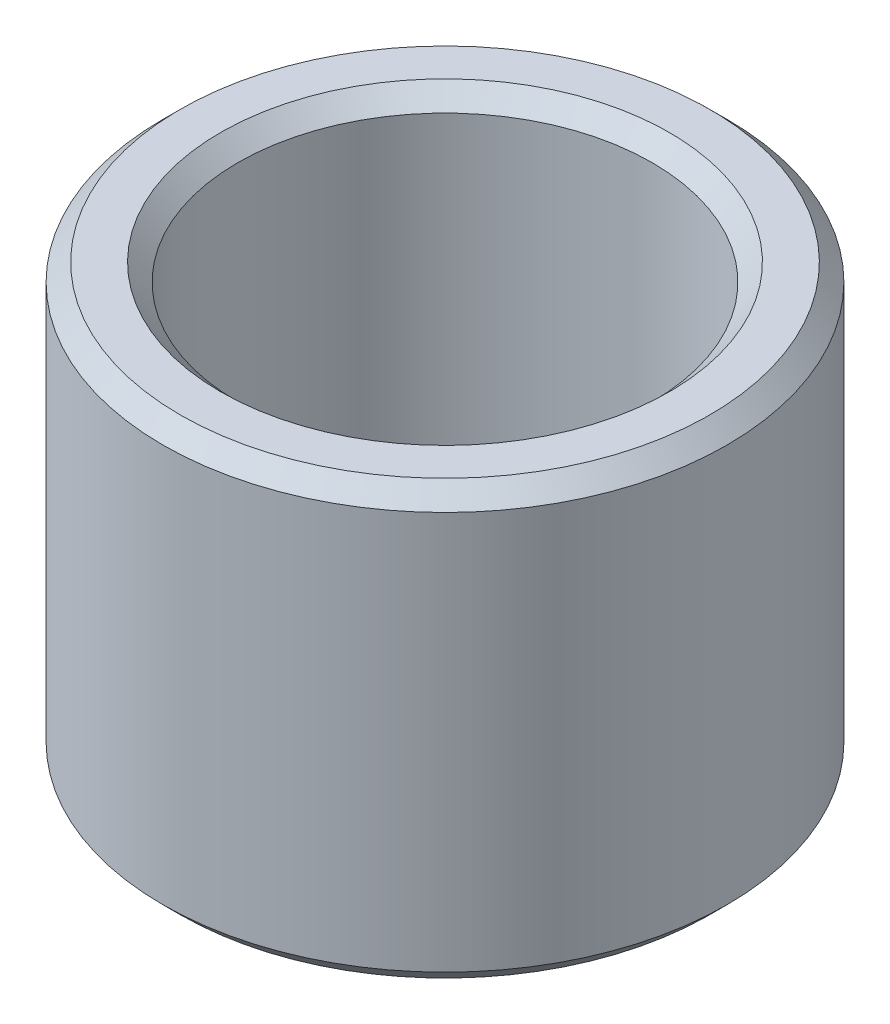
ISO-10303-21;
HEADER;
FILE_DESCRIPTION(('STEP AP214'),'2;1');
FILE_NAME('part.step','',(''),(''),'','','');
FILE_SCHEMA(('AUTOMOTIVE_DESIGN { 1 0 10303 214 1 1 1 1 }'));
ENDSEC;
DATA;
#1=APPLICATION_CONTEXT('core data for automotive mechanical design processes');
#2=APPLICATION_PROTOCOL_DEFINITION('international standard','automotive_design',2000,#1);
#3=PRODUCT_CONTEXT('',#1,'mechanical');
#4=PRODUCT('Part','Part','',(#3));
#5=PRODUCT_RELATED_PRODUCT_CATEGORY('part','',(#4));
#6=PRODUCT_DEFINITION_FORMATION('','',#4);
#7=PRODUCT_DEFINITION_CONTEXT('part definition',#1,'design');
#8=PRODUCT_DEFINITION('design','',#6,#7);
#9=PRODUCT_DEFINITION_SHAPE('','',#8);
#10=(LENGTH_UNIT() NAMED_UNIT(*) SI_UNIT(.MILLI.,.METRE.));
#11=(NAMED_UNIT(*) PLANE_ANGLE_UNIT() SI_UNIT($,.RADIAN.));
#12=(NAMED_UNIT(*) SI_UNIT($,.STERADIAN.) SOLID_ANGLE_UNIT());
#13=UNCERTAINTY_MEASURE_WITH_UNIT(LENGTH_MEASURE(1.E-05),#10,'distance_accuracy_value','');
#14=(GEOMETRIC_REPRESENTATION_CONTEXT(3) GLOBAL_UNCERTAINTY_ASSIGNED_CONTEXT((#13)) GLOBAL_UNIT_ASSIGNED_CONTEXT((#10,
#11,#12)) REPRESENTATION_CONTEXT('',''));
#15=CARTESIAN_POINT('',(0.,0.,0.));
#16=DIRECTION('',(0.,0.,1.));
#17=DIRECTION('',(1.,0.,0.));
#18=AXIS2_PLACEMENT_3D('',#15,#16,#17);
#19=CARTESIAN_POINT('',(0.,15.3442441906981,0.));
#20=DIRECTION('',(0.,-1.,0.));
#21=DIRECTION('',(0.,0.,-1.));
#22=AXIS2_PLACEMENT_3D('',#19,#20,#21);
#23=CYLINDRICAL_SURFACE('',#22,10.);
#24=CARTESIAN_POINT('',(0.,0.615494624692868,0.));
#25=DIRECTION('',(0.,1.,0.));
#26=DIRECTION('',(0.,0.,1.));
#27=AXIS2_PLACEMENT_3D('',#24,#25,#26);
#28=CIRCLE('',#27,10.);
#29=CARTESIAN_POINT('',(0.,0.615494624692868,10.));
#30=VERTEX_POINT('',#29);
#31=EDGE_CURVE('E10',#30,#30,#28,.T.);
#32=ORIENTED_EDGE('',*,*,#31,.T.);
#33=EDGE_LOOP('',(#32));
#34=FACE_BOUND('',#33,.T.);
#35=CARTESIAN_POINT('',(0.,14.7287495660052,0.));
#36=DIRECTION('',(0.,1.,0.));
#37=DIRECTION('',(0.,0.,1.));
#38=AXIS2_PLACEMENT_3D('',#35,#36,#37);
#39=CIRCLE('',#38,10.);
#40=CARTESIAN_POINT('',(0.,14.7287495660052,10.));
#41=VERTEX_POINT('',#40);
#42=EDGE_CURVE('E50',#41,#41,#39,.F.);
#43=ORIENTED_EDGE('',*,*,#42,.T.);
#44=EDGE_LOOP('',(#43));
#45=FACE_BOUND('',#44,.T.);
#46=ADVANCED_FACE('F39',(#34,#45),#23,.T.);
#47=CARTESIAN_POINT('',(0.,15.3442441906981,0.));
#48=DIRECTION('',(0.,1.,0.));
#49=DIRECTION('',(0.,0.,1.));
#50=AXIS2_PLACEMENT_3D('',#47,#48,#49);
#51=PLANE('',#50);
#52=CARTESIAN_POINT('',(0.,15.3442441906981,0.));
#53=DIRECTION('',(0.,1.,0.));
#54=DIRECTION('',(0.,0.,1.));
#55=AXIS2_PLACEMENT_3D('',#52,#53,#54);
#56=CIRCLE('',#55,7.95836799813763);
#57=CARTESIAN_POINT('',(0.,15.3442441906981,7.95836799813763));
#58=VERTEX_POINT('',#57);
#59=EDGE_CURVE('E58',#58,#58,#56,.F.);
#60=ORIENTED_EDGE('',*,*,#59,.T.);
#61=EDGE_LOOP('',(#60));
#62=FACE_BOUND('',#61,.T.);
#63=CARTESIAN_POINT('',(0.,15.3442441906981,0.));
#64=DIRECTION('',(0.,1.,0.));
#65=DIRECTION('',(0.,0.,1.));
#66=AXIS2_PLACEMENT_3D('',#63,#64,#65);
#67=CIRCLE('',#66,9.38450537530714);
#68=CARTESIAN_POINT('',(0.,15.3442441906981,9.38450537530714));
#69=VERTEX_POINT('',#68);
#70=EDGE_CURVE('E61',#69,#69,#67,.T.);
#71=ORIENTED_EDGE('',*,*,#70,.T.);
#72=EDGE_LOOP('',(#71));
#73=FACE_BOUND('',#72,.T.);
#74=ADVANCED_FACE('F88',(#62,#73),#51,.T.);
#75=CARTESIAN_POINT('',(0.,0.,0.));
#76=DIRECTION('',(0.,1.,0.));
#77=DIRECTION('',(0.,0.,1.));
#78=AXIS2_PLACEMENT_3D('',#75,#76,#77);
#79=PLANE('',#78);
#80=CARTESIAN_POINT('',(0.,0.,0.));
#81=DIRECTION('',(0.,1.,0.));
#82=DIRECTION('',(0.,0.,1.));
#83=AXIS2_PLACEMENT_3D('',#80,#81,#82);
#84=CIRCLE('',#83,7.95836799813762);
#85=CARTESIAN_POINT('',(0.,0.,7.95836799813762));
#86=VERTEX_POINT('',#85);
#87=EDGE_CURVE('E51',#86,#86,#84,.T.);
#88=ORIENTED_EDGE('',*,*,#87,.T.);
#89=EDGE_LOOP('',(#88));
#90=FACE_BOUND('',#89,.T.);
#91=CARTESIAN_POINT('',(0.,0.,0.));
#92=DIRECTION('',(0.,1.,0.));
#93=DIRECTION('',(0.,0.,1.));
#94=AXIS2_PLACEMENT_3D('',#91,#92,#93);
#95=CIRCLE('',#94,9.38450537530713);
#96=CARTESIAN_POINT('',(0.,0.,9.38450537530713));
#97=VERTEX_POINT('',#96);
#98=EDGE_CURVE('E54',#97,#97,#95,.F.);
#99=ORIENTED_EDGE('',*,*,#98,.T.);
#100=EDGE_LOOP('',(#99));
#101=FACE_BOUND('',#100,.T.);
#102=ADVANCED_FACE('F83',(#90,#101),#79,.F.);
#103=CARTESIAN_POINT('',(0.,15.3442441906981,0.));
#104=DIRECTION('',(0.,-1.,0.));
#105=DIRECTION('',(0.,0.,-1.));
#106=AXIS2_PLACEMENT_3D('',#103,#104,#105);
#107=CYLINDRICAL_SURFACE('',#106,7.34287337344476);
#108=CARTESIAN_POINT('',(0.,14.7287495660052,0.));
#109=DIRECTION('',(0.,1.,0.));
#110=DIRECTION('',(0.,0.,1.));
#111=AXIS2_PLACEMENT_3D('',#108,#109,#110);
#112=CIRCLE('',#111,7.34287337344476);
#113=CARTESIAN_POINT('',(0.,14.7287495660052,7.34287337344476));
#114=VERTEX_POINT('',#113);
#115=EDGE_CURVE('E67',#114,#114,#112,.T.);
#116=ORIENTED_EDGE('',*,*,#115,.T.);
#117=EDGE_LOOP('',(#116));
#118=FACE_BOUND('',#117,.T.);
#119=CARTESIAN_POINT('',(0.,0.61549462469287,0.));
#120=DIRECTION('',(0.,1.,0.));
#121=DIRECTION('',(0.,0.,1.));
#122=AXIS2_PLACEMENT_3D('',#119,#120,#121);
#123=CIRCLE('',#122,7.34287337344476);
#124=CARTESIAN_POINT('',(0.,0.61549462469287,7.34287337344476));
#125=VERTEX_POINT('',#124);
#126=EDGE_CURVE('E69',#125,#125,#123,.F.);
#127=ORIENTED_EDGE('',*,*,#126,.T.);
#128=EDGE_LOOP('',(#127));
#129=FACE_BOUND('',#128,.T.);
#130=ADVANCED_FACE('F71',(#118,#129),#107,.F.);
#131=CARTESIAN_POINT('',(0.,14.7287495660052,0.));
#132=DIRECTION('',(0.,1.,0.));
#133=DIRECTION('',(0.,0.,1.));
#134=AXIS2_PLACEMENT_3D('',#131,#132,#133);
#135=CONICAL_SURFACE('',#134,7.34287337344476,0.78539816339745);
#136=ORIENTED_EDGE('',*,*,#59,.F.);
#137=EDGE_LOOP('',(#136));
#138=FACE_BOUND('',#137,.T.);
#139=ORIENTED_EDGE('',*,*,#115,.F.);
#140=EDGE_LOOP('',(#139));
#141=FACE_BOUND('',#140,.T.);
#142=ADVANCED_FACE('F77',(#138,#141),#135,.F.);
#143=CARTESIAN_POINT('',(0.,0.,0.));
#144=DIRECTION('',(0.,-1.,0.));
#145=DIRECTION('',(0.,0.,-1.));
#146=AXIS2_PLACEMENT_3D('',#143,#144,#145);
#147=CONICAL_SURFACE('',#146,7.95836799813762,0.785398163397445);
#148=ORIENTED_EDGE('',*,*,#126,.F.);
#149=EDGE_LOOP('',(#148));
#150=FACE_BOUND('',#149,.T.);
#151=ORIENTED_EDGE('',*,*,#87,.F.);
#152=EDGE_LOOP('',(#151));
#153=FACE_BOUND('',#152,.T.);
#154=ADVANCED_FACE('F73',(#150,#153),#147,.F.);
#155=CARTESIAN_POINT('',(0.,0.615494624692868,0.));
#156=DIRECTION('',(0.,1.,0.));
#157=DIRECTION('',(0.,0.,1.));
#158=AXIS2_PLACEMENT_3D('',#155,#156,#157);
#159=CONICAL_SURFACE('',#158,10.,0.785398163397452);
#160=ORIENTED_EDGE('',*,*,#98,.F.);
#161=EDGE_LOOP('',(#160));
#162=FACE_BOUND('',#161,.T.);
#163=ORIENTED_EDGE('',*,*,#31,.F.);
#164=EDGE_LOOP('',(#163));
#165=FACE_BOUND('',#164,.T.);
#166=ADVANCED_FACE('F76',(#162,#165),#159,.T.);
#167=CARTESIAN_POINT('',(0.,15.3442441906981,0.));
#168=DIRECTION('',(0.,-1.,0.));
#169=DIRECTION('',(0.,0.,-1.));
#170=AXIS2_PLACEMENT_3D('',#167,#168,#169);
#171=CONICAL_SURFACE('',#170,9.38450537530714,0.785398163397443);
#172=ORIENTED_EDGE('',*,*,#42,.F.);
#173=EDGE_LOOP('',(#172));
#174=FACE_BOUND('',#173,.T.);
#175=ORIENTED_EDGE('',*,*,#70,.F.);
#176=EDGE_LOOP('',(#175));
#177=FACE_BOUND('',#176,.T.);
#178=ADVANCED_FACE('F45',(#174,#177),#171,.T.);
#179=CLOSED_SHELL('',(#46,#74,#102,#130,#142,#154,#166,#178));
#180=MANIFOLD_SOLID_BREP('B2',#179);
#181=ADVANCED_BREP_SHAPE_REPRESENTATION('',(#18,#180),#14);
#182=SHAPE_DEFINITION_REPRESENTATION(#9,#181);
ENDSEC;
END-ISO-10303-21;
